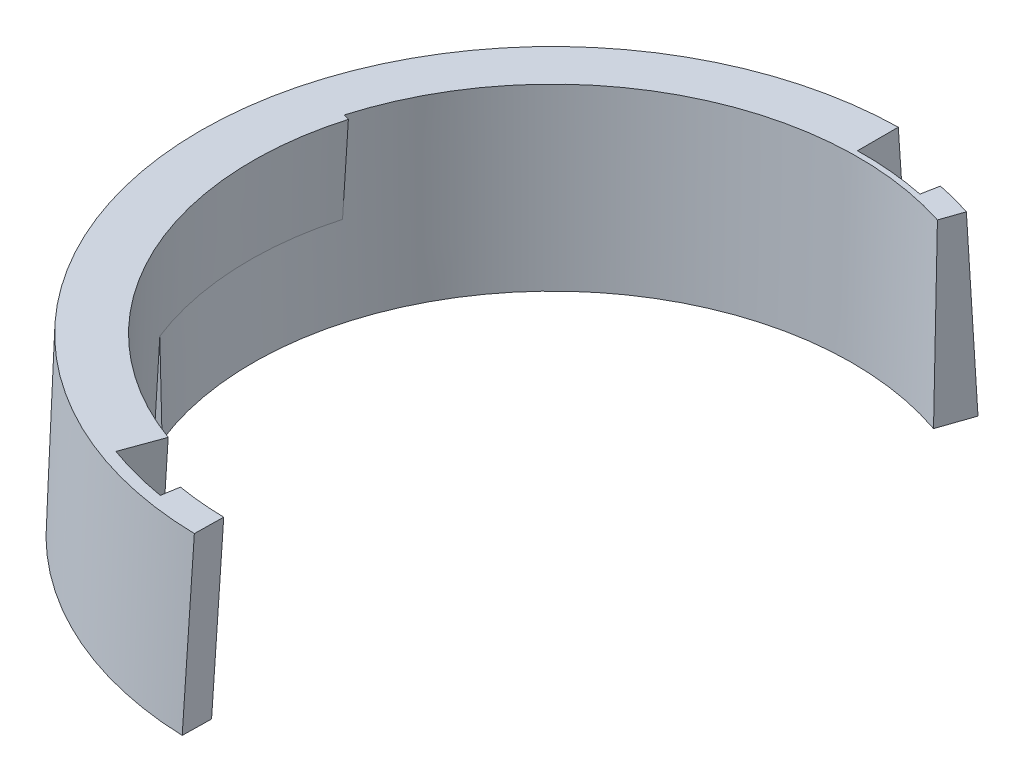
ISO-10303-21;
HEADER;
FILE_DESCRIPTION(('STEP AP214'),'2;1');
FILE_NAME('part.step','',(''),(''),'','','');
FILE_SCHEMA(('AUTOMOTIVE_DESIGN { 1 0 10303 214 1 1 1 1 }'));
ENDSEC;
DATA;
#1=APPLICATION_CONTEXT('core data for automotive mechanical design processes');
#2=APPLICATION_PROTOCOL_DEFINITION('international standard','automotive_design',2000,#1);
#3=PRODUCT_CONTEXT('',#1,'mechanical');
#4=PRODUCT('Part','Part','',(#3));
#5=PRODUCT_RELATED_PRODUCT_CATEGORY('part','',(#4));
#6=PRODUCT_DEFINITION_FORMATION('','',#4);
#7=PRODUCT_DEFINITION_CONTEXT('part definition',#1,'design');
#8=PRODUCT_DEFINITION('design','',#6,#7);
#9=PRODUCT_DEFINITION_SHAPE('','',#8);
#10=(LENGTH_UNIT() NAMED_UNIT(*) SI_UNIT(.MILLI.,.METRE.));
#11=(NAMED_UNIT(*) PLANE_ANGLE_UNIT() SI_UNIT($,.RADIAN.));
#12=(NAMED_UNIT(*) SI_UNIT($,.STERADIAN.) SOLID_ANGLE_UNIT());
#13=UNCERTAINTY_MEASURE_WITH_UNIT(LENGTH_MEASURE(1.E-05),#10,'distance_accuracy_value','');
#14=(GEOMETRIC_REPRESENTATION_CONTEXT(3) GLOBAL_UNCERTAINTY_ASSIGNED_CONTEXT((#13)) GLOBAL_UNIT_ASSIGNED_CONTEXT((#10,
#11,#12)) REPRESENTATION_CONTEXT('',''));
#15=CARTESIAN_POINT('',(0.,0.,0.));
#16=DIRECTION('',(0.,0.,1.));
#17=DIRECTION('',(1.,0.,0.));
#18=AXIS2_PLACEMENT_3D('',#15,#16,#17);
#19=CARTESIAN_POINT('',(0.,0.,0.));
#20=DIRECTION('',(0.,-1.,0.));
#21=DIRECTION('',(0.,0.,1.));
#22=AXIS2_PLACEMENT_3D('',#19,#20,#21);
#23=CONICAL_SURFACE('',#22,61.4034381309657,0.0349065850398866);
#24=CARTESIAN_POINT('',(0.,0.,0.));
#25=DIRECTION('',(0.,1.,0.));
#26=DIRECTION('',(0.,0.,1.));
#27=AXIS2_PLACEMENT_3D('',#24,#25,#26);
#28=CIRCLE('',#27,61.4034381309657);
#29=CARTESIAN_POINT('',(0.,0.,-61.4034381309657));
#30=VERTEX_POINT('',#29);
#31=CARTESIAN_POINT('',(-2.1189453036349,0.,61.3668663458021));
#32=VERTEX_POINT('',#31);
#33=EDGE_CURVE('E336',#30,#32,#28,.T.);
#34=ORIENTED_EDGE('',*,*,#33,.T.);
#35=CARTESIAN_POINT('',(-1.58727670122712,14.9682723992569,60.8578227023238));
#36=DIRECTION('',(-0.035476834527025,-0.998793085918968,0.0339671272321784));
#37=VECTOR('',#36,1.);
#38=LINE('',#35,#37);
#39=CARTESIAN_POINT('',(-1.58728567355379,14.9682915355134,60.8583759642603));
#40=VERTEX_POINT('',#39);
#41=EDGE_CURVE('E386',#40,#32,#38,.T.);
#42=ORIENTED_EDGE('',*,*,#41,.F.);
#43=CARTESIAN_POINT('',(-1.58731259083646,14.968348935764,60.8600357503626));
#44=CARTESIAN_POINT('',(-1.5872657472667,14.9696677422018,60.85999090271));
#45=CARTESIAN_POINT('',(-1.58721890369612,14.9709865486378,60.8599460550061));
#46=CARTESIAN_POINT('',(-1.58712521667649,14.9736241580376,60.8598563596136));
#47=CARTESIAN_POINT('',(-1.58707837322745,14.9749429610014,60.8598115119251));
#48=CARTESIAN_POINT('',(-1.58698468645092,14.9775805634567,60.8597218165633));
#49=CARTESIAN_POINT('',(-1.58693784312342,14.9788993629482,60.8596769688901));
#50=CARTESIAN_POINT('',(-1.58684415658999,14.9815369584589,60.8595872735591));
#51=CARTESIAN_POINT('',(-1.58679731338404,14.9828557544781,60.8595424259013));
#52=CARTESIAN_POINT('',(-1.5867036270937,14.9854933430442,60.859452730601));
#53=CARTESIAN_POINT('',(-1.5866567840093,14.9868121355912,60.8594078829586));
#54=CARTESIAN_POINT('',(-1.58656309796205,14.9894497172128,60.859318187689));
#55=CARTESIAN_POINT('',(-1.5865162549992,14.9907685062875,60.8592733400619));
#56=CARTESIAN_POINT('',(-1.58642256919505,14.9934060809645,60.8591836448231));
#57=CARTESIAN_POINT('',(-1.58637572635375,14.9947248665669,60.8591387972114));
#58=CARTESIAN_POINT('',(-1.58628204079269,14.9973624342994,60.8590491020033));
#59=CARTESIAN_POINT('',(-1.58623519807293,14.9986812164295,60.8590042544069));
#60=CARTESIAN_POINT('',(-1.58618835535235,14.9999999985579,60.8589594067593));
#61=B_SPLINE_CURVE_WITH_KNOTS('',3,(#43,#44,#45,#46,#47,#48,#49,#50,#51,#52,#53,#54,#55,#56,#57,
#58,#59,#60),.UNSPECIFIED.,.F.,.F.,(4,2,2,2,2,2,2,2,4),(0.,0.00396119987777217,
0.00792238933678482,0.0118835683770402,0.0158447369985381,0.0198058952012765,0.0237670429852575,
0.0277281803504851,0.031689307296948),.UNSPECIFIED.);
#62=CARTESIAN_POINT('',(-1.5861704101341,14.9999617294203,60.8578528571751));
#63=VERTEX_POINT('',#62);
#64=EDGE_CURVE('E372',#40,#63,#61,.T.);
#65=ORIENTED_EDGE('',*,*,#64,.T.);
#66=CARTESIAN_POINT('',(-1.05334711005954,30.0002,60.3466157020415));
#67=CARTESIAN_POINT('',(-1.22795560002416,25.0850928764568,60.5152212962289));
#68=CARTESIAN_POINT('',(-1.40255250684312,20.1699610921106,60.6831139482932));
#69=CARTESIAN_POINT('',(-1.75172315412765,10.3396482035604,61.0174733681161));
#70=CARTESIAN_POINT('',(-1.92629689459322,5.42446709935634,61.1839401358751));
#71=CARTESIAN_POINT('',(-2.10085905191316,0.509261334349333,61.3496939615115));
#72=B_SPLINE_CURVE_WITH_KNOTS('',3,(#66,#67,#68,#69,#70,#71),.UNSPECIFIED.,.F.,.F.,(4,2,4),(0.,
14.7632900235618,29.5265800418733),.UNSPECIFIED.);
#73=CARTESIAN_POINT('',(-1.05329381391964,30.001686219635,60.3465361663429));
#74=VERTEX_POINT('',#73);
#75=EDGE_CURVE('E202',#74,#63,#72,.T.);
#76=ORIENTED_EDGE('',*,*,#75,.F.);
#77=CARTESIAN_POINT('',(0.,30.,0.));
#78=DIRECTION('',(0.,1.,0.));
#79=DIRECTION('',(0.,0.,1.));
#80=AXIS2_PLACEMENT_3D('',#77,#78,#79);
#81=CIRCLE('',#80,60.3558150462133);
#82=CARTESIAN_POINT('',(-1.04762308475243,30.,-60.3467223282674));
#83=VERTEX_POINT('',#82);
#84=EDGE_CURVE('E604',#83,#74,#81,.T.);
#85=ORIENTED_EDGE('',*,*,#84,.F.);
#86=CARTESIAN_POINT('',(-1.04762308475243,30.,-60.3467223282674));
#87=CARTESIAN_POINT('',(-0.873021112862397,25.0000537092604,-60.5243683143377));
#88=CARTESIAN_POINT('',(-0.698418203170522,20.0000805633899,-60.7012509576153));
#89=CARTESIAN_POINT('',(-0.349210508253044,10.0000805633898,-61.0534895585141));
#90=CARTESIAN_POINT('',(-0.174605723027441,5.0000537092604,-61.228845516136));
#91=CARTESIAN_POINT('',(0.,0.,-61.4034381309657));
#92=B_SPLINE_CURVE_WITH_KNOTS('',3,(#86,#87,#88,#89,#90,#91),.UNSPECIFIED.,.F.,.F.,(4,2,4),(0.,
15.0184401968025,30.0368803875884),.UNSPECIFIED.);
#93=EDGE_CURVE('E258',#83,#30,#92,.T.);
#94=ORIENTED_EDGE('',*,*,#93,.T.);
#95=EDGE_LOOP('',(#34,#42,#65,#76,#85,#94));
#96=FACE_BOUND('',#95,.T.);
#97=ADVANCED_FACE('F53',(#96),#23,.T.);
#98=CARTESIAN_POINT('',(0.,30.,0.));
#99=DIRECTION('',(0.,-1.,0.));
#100=DIRECTION('',(0.,0.,1.));
#101=AXIS2_PLACEMENT_3D('',#98,#99,#100);
#102=CONICAL_SURFACE('',#101,51.4034381309657,0.0349065850398866);
#103=CARTESIAN_POINT('',(0.,0.,0.));
#104=DIRECTION('',(0.,1.,0.));
#105=DIRECTION('',(0.,0.,1.));
#106=AXIS2_PLACEMENT_3D('',#103,#104,#105);
#107=CIRCLE('',#106,52.4510612157182);
#108=CARTESIAN_POINT('',(-48.6215238860801,0.,19.6738719536942));
#109=VERTEX_POINT('',#108);
#110=CARTESIAN_POINT('',(-18.9201844933115,0.,48.9197346823761));
#111=VERTEX_POINT('',#110);
#112=EDGE_CURVE('E423',#109,#111,#107,.T.);
#113=ORIENTED_EDGE('',*,*,#112,.F.);
#114=CARTESIAN_POINT('',(-48.6215277406224,-0.0002,19.6738810476102));
#115=CARTESIAN_POINT('',(-48.5527802093637,3.56720435453582,19.5116751068177));
#116=CARTESIAN_POINT('',(-48.483612596789,7.13459279702392,19.3492997866978));
#117=CARTESIAN_POINT('',(-48.3444372089912,14.2693378587291,19.0242103877654));
#118=CARTESIAN_POINT('',(-48.274429433768,17.8366944779462,18.8614963089529));
#119=CARTESIAN_POINT('',(-48.2040015772285,21.4040351851156,18.6986128508128));
#120=B_SPLINE_CURVE_WITH_KNOTS('',3,(#114,#115,#116,#117,#118,#119),.UNSPECIFIED.,.F.,.F.,(4,2,
4),(0.,10.7152550984706,21.4305101994175),.UNSPECIFIED.);
#121=CARTESIAN_POINT('',(-48.3299840617232,15.0000000000001,18.9908372440811));
#122=VERTEX_POINT('',#121);
#123=EDGE_CURVE('E224',#109,#122,#120,.T.);
#124=ORIENTED_EDGE('',*,*,#123,.T.);
#125=CARTESIAN_POINT('',(0.,15.0000000000001,0.));
#126=DIRECTION('',(0.,-1.,0.));
#127=DIRECTION('',(0.,0.,-1.));
#128=AXIS2_PLACEMENT_3D('',#125,#126,#127);
#129=CIRCLE('',#128,51.927249673342);
#130=CARTESIAN_POINT('',(-50.0018798350972,15.0000000000001,-14.0089711111877));
#131=VERTEX_POINT('',#130);
#132=EDGE_CURVE('E231',#131,#122,#129,.F.);
#133=ORIENTED_EDGE('',*,*,#132,.F.);
#134=CARTESIAN_POINT('',(-50.6437036488404,0.,-13.6502418800343));
#135=CARTESIAN_POINT('',(-50.4305886348222,5.00005954067846,-13.770060962457));
#136=CARTESIAN_POINT('',(-50.2166460849028,10.0000893102687,-13.8896380833683));
#137=CARTESIAN_POINT('',(-49.7871059131332,20.0000893102688,-14.1283084022398));
#138=CARTESIAN_POINT('',(-49.571508291282,25.0000595406785,-14.2474016001997));
#139=CARTESIAN_POINT('',(-49.3550831335287,30.,-14.3662528366479));
#140=B_SPLINE_CURVE_WITH_KNOTS('',3,(#134,#135,#136,#137,#138,#139),.UNSPECIFIED.,.F.,.F.,(4,2,
4),(0.,15.0180994201564,30.0361988493114),.UNSPECIFIED.);
#141=CARTESIAN_POINT('',(-49.3550831335287,30.,-14.3662528366479));
#142=VERTEX_POINT('',#141);
#143=EDGE_CURVE('E185',#131,#142,#140,.T.);
#144=ORIENTED_EDGE('',*,*,#143,.T.);
#145=CARTESIAN_POINT('',(0.,30.,0.));
#146=DIRECTION('',(0.,1.,0.));
#147=DIRECTION('',(0.,0.,1.));
#148=AXIS2_PLACEMENT_3D('',#145,#146,#147);
#149=CIRCLE('',#148,51.4034381309657);
#150=CARTESIAN_POINT('',(-17.5810112769854,30.,48.3034314946934));
#151=VERTEX_POINT('',#150);
#152=EDGE_CURVE('E355',#142,#151,#149,.T.);
#153=ORIENTED_EDGE('',*,*,#152,.T.);
#154=CARTESIAN_POINT('',(-18.9201844933115,0.,48.9197346823761));
#155=CARTESIAN_POINT('',(-18.697576771539,5.00005954067846,48.8186385700876));
#156=CARTESIAN_POINT('',(-18.474675142659,10.0000893102687,48.7167319149854));
#157=CARTESIAN_POINT('',(-18.0282840705507,20.0000893102688,48.5112975190921));
#158=CARTESIAN_POINT('',(-17.8047946273219,25.0000595406785,48.4077697783001));
#159=CARTESIAN_POINT('',(-17.5810112769854,30.,48.3034314946933));
#160=B_SPLINE_CURVE_WITH_KNOTS('',3,(#154,#155,#156,#157,#158,#159),.UNSPECIFIED.,.F.,.F.,(4,2,
4),(0.,15.0180994201564,30.0361988493114),.UNSPECIFIED.);
#161=EDGE_CURVE('E218',#111,#151,#160,.T.);
#162=ORIENTED_EDGE('',*,*,#161,.F.);
#163=EDGE_LOOP('',(#113,#124,#133,#144,#153,#162));
#164=FACE_BOUND('',#163,.T.);
#165=ADVANCED_FACE('F208',(#164),#102,.F.);
#166=CARTESIAN_POINT('',(0.,0.,0.));
#167=DIRECTION('',(0.,1.,0.));
#168=DIRECTION('',(0.,0.,1.));
#169=AXIS2_PLACEMENT_3D('',#166,#167,#168);
#170=PLANE('',#169);
#171=DIRECTION('',(-0.325568154457157,0.,0.945518575599317));
#172=VECTOR('',#171,1.);
#173=CARTESIAN_POINT('',(0.,0.,0.));
#174=LINE('',#173,#172);
#175=CARTESIAN_POINT('',(18.6887314117941,0.,-54.2760170560942));
#176=VERTEX_POINT('',#175);
#177=CARTESIAN_POINT('',(16.7353224850512,0.,-48.6029056024983));
#178=VERTEX_POINT('',#177);
#179=EDGE_CURVE('E325',#176,#178,#174,.T.);
#180=ORIENTED_EDGE('',*,*,#179,.T.);
#181=CARTESIAN_POINT('',(0.,0.,0.));
#182=DIRECTION('',(0.,1.,0.));
#183=DIRECTION('',(0.,0.,1.));
#184=AXIS2_PLACEMENT_3D('',#181,#182,#183);
#185=CIRCLE('',#184,51.4034381309657);
#186=CARTESIAN_POINT('',(-47.6503894674759,0.,19.2809189428793));
#187=VERTEX_POINT('',#186);
#188=EDGE_CURVE('E328',#178,#187,#185,.T.);
#189=ORIENTED_EDGE('',*,*,#188,.T.);
#190=DIRECTION('',(0.926988372763554,0.,-0.375090064865999));
#191=VECTOR('',#190,1.);
#192=CARTESIAN_POINT('',(0.,0.,0.));
#193=LINE('',#192,#191);
#194=EDGE_CURVE('E332',#109,#187,#193,.T.);
#195=ORIENTED_EDGE('',*,*,#194,.F.);
#196=ORIENTED_EDGE('',*,*,#112,.T.);
#197=DIRECTION('',(0.342020143325675,0.,-0.939692620785906));
#198=VECTOR('',#197,1.);
#199=CARTESIAN_POINT('',(-0.984443682106884,0.,-0.358308197598333));
#200=LINE('',#199,#198);
#201=CARTESIAN_POINT('',(-21.3147469321907,0.,55.4987409126706));
#202=VERTEX_POINT('',#201);
#203=EDGE_CURVE('E369',#202,#111,#200,.T.);
#204=ORIENTED_EDGE('',*,*,#203,.F.);
#205=CARTESIAN_POINT('',(0.,0.,0.));
#206=DIRECTION('',(0.,1.,0.));
#207=DIRECTION('',(0.,0.,1.));
#208=AXIS2_PLACEMENT_3D('',#205,#206,#207);
#209=CIRCLE('',#208,59.4510612157182);
#210=CARTESIAN_POINT('',(-8.77747618152844,0.,58.7995288378893));
#211=VERTEX_POINT('',#210);
#212=EDGE_CURVE('E428',#202,#211,#209,.T.);
#213=ORIENTED_EDGE('',*,*,#212,.T.);
#214=DIRECTION('',(-0.165047605860686,0.,0.98628560153723));
#215=VECTOR('',#214,1.);
#216=CARTESIAN_POINT('',(1.0332555643294,0.,0.172907681982786));
#217=LINE('',#216,#215);
#218=CARTESIAN_POINT('',(-8.28225238250266,0.,55.840188107252));
#219=VERTEX_POINT('',#218);
#220=EDGE_CURVE('E172',#211,#219,#217,.F.);
#221=ORIENTED_EDGE('',*,*,#220,.T.);
#222=CARTESIAN_POINT('',(0.,0.,0.));
#223=DIRECTION('',(0.,1.,0.));
#224=DIRECTION('',(0.,0.,1.));
#225=AXIS2_PLACEMENT_3D('',#222,#223,#224);
#226=CIRCLE('',#225,56.4510612157182);
#227=CARTESIAN_POINT('',(-2.03250072252684,0.,56.4144596109339));
#228=VERTEX_POINT('',#227);
#229=EDGE_CURVE('E360',#228,#219,#226,.F.);
#230=ORIENTED_EDGE('',*,*,#229,.F.);
#231=DIRECTION('',(0.0174524064372834,0.,-0.999847695156391));
#232=VECTOR('',#231,1.);
#233=CARTESIAN_POINT('',(-1.04746352668235,0.,-0.01828354386818));
#234=LINE('',#233,#232);
#235=EDGE_CURVE('E356',#228,#32,#234,.F.);
#236=ORIENTED_EDGE('',*,*,#235,.T.);
#237=ORIENTED_EDGE('',*,*,#33,.F.);
#238=DIRECTION('',(0.,0.,1.));
#239=VECTOR('',#238,1.);
#240=CARTESIAN_POINT('',(0.,0.,0.));
#241=LINE('',#240,#239);
#242=CARTESIAN_POINT('',(0.,0.,-54.4034381309657));
#243=VERTEX_POINT('',#242);
#244=EDGE_CURVE('E333',#30,#243,#241,.T.);
#245=ORIENTED_EDGE('',*,*,#244,.T.);
#246=CARTESIAN_POINT('',(0.,0.,0.));
#247=DIRECTION('',(0.,1.,0.));
#248=DIRECTION('',(0.,0.,1.));
#249=AXIS2_PLACEMENT_3D('',#246,#247,#248);
#250=CIRCLE('',#249,54.4034381309657);
#251=CARTESIAN_POINT('',(9.91423913637608,0.,-53.492447530624));
#252=VERTEX_POINT('',#251);
#253=EDGE_CURVE('E335',#243,#252,#250,.F.);
#254=ORIENTED_EDGE('',*,*,#253,.T.);
#255=DIRECTION('',(-0.182235525492148,0.,0.983254907563955));
#256=VECTOR('',#255,1.);
#257=CARTESIAN_POINT('',(0.,0.,0.));
#258=LINE('',#257,#256);
#259=CARTESIAN_POINT('',(10.4609457128525,0.,-56.4422122533159));
#260=VERTEX_POINT('',#259);
#261=EDGE_CURVE('E319',#260,#252,#258,.T.);
#262=ORIENTED_EDGE('',*,*,#261,.F.);
#263=CARTESIAN_POINT('',(0.,0.,0.));
#264=DIRECTION('',(0.,1.,0.));
#265=DIRECTION('',(0.,0.,1.));
#266=AXIS2_PLACEMENT_3D('',#263,#264,#265);
#267=CIRCLE('',#266,57.4034381309657);
#268=EDGE_CURVE('E322',#176,#260,#267,.T.);
#269=ORIENTED_EDGE('',*,*,#268,.F.);
#270=EDGE_LOOP('',(#180,#189,#195,#196,#204,#213,#221,#230,#236,#237,#245,#254,#262,#269));
#271=FACE_BOUND('',#270,.T.);
#272=ADVANCED_FACE('F211',(#271),#170,.F.);
#273=CARTESIAN_POINT('',(0.,0.,0.));
#274=DIRECTION('',(0.374861570133077,0.034899496702501,0.926423676493254));
#275=DIRECTION('',(0.926988372763554,0.,-0.375090064865999));
#276=AXIS2_PLACEMENT_3D('',#273,#274,#275);
#277=PLANE('',#276);
#278=ORIENTED_EDGE('',*,*,#123,.F.);
#279=ORIENTED_EDGE('',*,*,#194,.T.);
#280=CARTESIAN_POINT('',(-49.0047775285767,30.,18.6988128508128));
#281=CARTESIAN_POINT('',(-48.780643872918,24.9999404593215,18.7964792529873));
#282=CARTESIAN_POINT('',(-48.5557113733644,19.9999106897313,18.8938212950656));
#283=CARTESIAN_POINT('',(-48.1042486863317,9.99991068973124,19.0878566590882));
#284=CARTESIAN_POINT('',(-47.8777184988518,4.9999404593215,19.184549981032));
#285=CARTESIAN_POINT('',(-47.6503894674759,0.,19.2809189428793));
#286=B_SPLINE_CURVE_WITH_KNOTS('',3,(#280,#281,#282,#283,#284,#285),.UNSPECIFIED.,.F.,.F.,(4,2,
4),(0.,15.0180994201564,30.0361988493114),.UNSPECIFIED.);
#287=EDGE_CURVE('E250',#122,#187,#286,.T.);
#288=ORIENTED_EDGE('',*,*,#287,.F.);
#289=EDGE_LOOP('',(#278,#279,#288));
#290=FACE_BOUND('',#289,.T.);
#291=ADVANCED_FACE('F239',(#290),#277,.T.);
#292=CARTESIAN_POINT('',(0.,0.,0.));
#293=DIRECTION('',(0.999390827019096,0.034899496702501,0.));
#294=DIRECTION('',(-0.034899496702501,0.999390827019096,0.));
#295=AXIS2_PLACEMENT_3D('',#292,#293,#294);
#296=PLANE('',#295);
#297=ORIENTED_EDGE('',*,*,#244,.F.);
#298=ORIENTED_EDGE('',*,*,#93,.F.);
#299=DIRECTION('',(0.,0.,1.));
#300=VECTOR('',#299,1.);
#301=CARTESIAN_POINT('',(-1.04762308475243,30.,0.));
#302=LINE('',#301,#300);
#303=CARTESIAN_POINT('',(-1.04762308475243,30.,-53.3455291952195));
#304=VERTEX_POINT('',#303);
#305=EDGE_CURVE('E610',#83,#304,#302,.T.);
#306=ORIENTED_EDGE('',*,*,#305,.T.);
#307=CARTESIAN_POINT('',(-1.04762308475243,30.,-53.3455291952195));
#308=CARTESIAN_POINT('',(-0.873021363737469,25.0000608933826,-53.5235763022949));
#309=CARTESIAN_POINT('',(-0.698418579475277,20.0000913393482,-53.7007589338368));
#310=CARTESIAN_POINT('',(-0.349210884557798,10.0000913393481,-54.0533952457512));
#311=CARTESIAN_POINT('',(-0.174605973902513,5.00006089338253,-54.2288489261247));
#312=CARTESIAN_POINT('',(0.,0.,-54.4034381309657));
#313=B_SPLINE_CURVE_WITH_KNOTS('',3,(#307,#308,#309,#310,#311,#312),.UNSPECIFIED.,.F.,.F.,(4,2,
4),(0.,15.018461246951,30.0369224851831),.UNSPECIFIED.);
#314=EDGE_CURVE('E314',#304,#243,#313,.T.);
#315=ORIENTED_EDGE('',*,*,#314,.T.);
#316=EDGE_LOOP('',(#297,#298,#306,#315));
#317=FACE_BOUND('',#316,.T.);
#318=ADVANCED_FACE('F243',(#317),#296,.T.);
#319=CARTESIAN_POINT('',(0.,0.,0.));
#320=DIRECTION('',(0.,-1.,0.));
#321=DIRECTION('',(0.,0.,1.));
#322=AXIS2_PLACEMENT_3D('',#319,#320,#321);
#323=CONICAL_SURFACE('',#322,54.4034381309657,0.0349065850398866);
#324=ORIENTED_EDGE('',*,*,#253,.F.);
#325=ORIENTED_EDGE('',*,*,#314,.F.);
#326=CARTESIAN_POINT('',(0.,30.,0.));
#327=DIRECTION('',(0.,1.,0.));
#328=DIRECTION('',(0.,0.,1.));
#329=AXIS2_PLACEMENT_3D('',#326,#327,#328);
#330=CIRCLE('',#329,53.3558150462133);
#331=CARTESIAN_POINT('',(10.7515310849076,30.,-52.2613392344282));
#332=VERTEX_POINT('',#331);
#333=EDGE_CURVE('E323',#304,#332,#330,.F.);
#334=ORIENTED_EDGE('',*,*,#333,.T.);
#335=CARTESIAN_POINT('',(10.7515310849076,30.,-52.2613392344282));
#336=CARTESIAN_POINT('',(10.6122995939708,25.0000608933826,-52.4682235626186));
#337=CARTESIAN_POINT('',(10.4729095194378,20.0000913393482,-52.6742580847597));
#338=CARTESIAN_POINT('',(10.1938122032604,10.0000913393481,-53.084627516824));
#339=CARTESIAN_POINT('',(10.0541049616162,5.00006089338253,-53.2889624267482));
#340=CARTESIAN_POINT('',(9.91423913637607,0.,-53.492447530624));
#341=B_SPLINE_CURVE_WITH_KNOTS('',3,(#335,#336,#337,#338,#339,#340),.UNSPECIFIED.,.F.,.F.,(4,2,
4),(0.,15.018461246951,30.0369224851831),.UNSPECIFIED.);
#342=EDGE_CURVE('E296',#332,#252,#341,.T.);
#343=ORIENTED_EDGE('',*,*,#342,.T.);
#344=EDGE_LOOP('',(#324,#325,#334,#343));
#345=FACE_BOUND('',#344,.T.);
#346=ADVANCED_FACE('F305',(#345),#323,.T.);
#347=CARTESIAN_POINT('',(0.,0.,0.));
#348=DIRECTION('',(-0.982655935240925,0.034899496702501,-0.182124512533857));
#349=DIRECTION('',(-0.182235525492148,0.,0.983254907563955));
#350=AXIS2_PLACEMENT_3D('',#347,#348,#349);
#351=PLANE('',#350);
#352=ORIENTED_EDGE('',*,*,#261,.T.);
#353=ORIENTED_EDGE('',*,*,#342,.F.);
#354=DIRECTION('',(0.182235525492148,0.,-0.983254907563955));
#355=VECTOR('',#354,1.);
#356=CARTESIAN_POINT('',(1.0300805393601,30.,0.19091414336756));
#357=LINE('',#356,#355);
#358=CARTESIAN_POINT('',(11.2983374619385,30.,-55.2116424327257));
#359=VERTEX_POINT('',#358);
#360=EDGE_CURVE('E597',#359,#332,#357,.F.);
#361=ORIENTED_EDGE('',*,*,#360,.F.);
#362=CARTESIAN_POINT('',(11.2983374619385,30.,-55.2116424327257));
#363=CARTESIAN_POINT('',(11.1590722954227,25.0000575919434,-55.4183456963874));
#364=CARTESIAN_POINT('',(11.0196570663904,20.0000863872996,-55.6242448132925));
#365=CARTESIAN_POINT('',(10.7405264833615,10.0000863872995,-56.0344347534884));
#366=CARTESIAN_POINT('',(10.6008111293652,5.00005759194337,-56.2387255767801));
#367=CARTESIAN_POINT('',(10.4609457128525,0.,-56.4422122533159));
#368=B_SPLINE_CURVE_WITH_KNOTS('',3,(#362,#363,#364,#365,#366,#367),.UNSPECIFIED.,.F.,.F.,(4,2,
4),(0.,15.0184515812138,30.0369031550322),.UNSPECIFIED.);
#369=EDGE_CURVE('E290',#359,#260,#368,.T.);
#370=ORIENTED_EDGE('',*,*,#369,.T.);
#371=EDGE_LOOP('',(#352,#353,#361,#370));
#372=FACE_BOUND('',#371,.T.);
#373=ADVANCED_FACE('F302',(#372),#351,.T.);
#374=CARTESIAN_POINT('',(0.,0.,0.));
#375=DIRECTION('',(0.,-1.,0.));
#376=DIRECTION('',(0.,0.,1.));
#377=AXIS2_PLACEMENT_3D('',#374,#375,#376);
#378=CONICAL_SURFACE('',#377,57.4034381309657,0.0349065850398866);
#379=ORIENTED_EDGE('',*,*,#268,.T.);
#380=ORIENTED_EDGE('',*,*,#369,.F.);
#381=CARTESIAN_POINT('',(0.,30.,0.));
#382=DIRECTION('',(0.,1.,0.));
#383=DIRECTION('',(0.,0.,1.));
#384=AXIS2_PLACEMENT_3D('',#381,#382,#383);
#385=CIRCLE('',#384,56.3558150462133);
#386=CARTESIAN_POINT('',(17.3539411612331,30.,-53.617335029778));
#387=VERTEX_POINT('',#386);
#388=EDGE_CURVE('E600',#387,#359,#385,.T.);
#389=ORIENTED_EDGE('',*,*,#388,.F.);
#390=CARTESIAN_POINT('',(17.3539411612331,30.,-53.617335029778));
#391=CARTESIAN_POINT('',(17.5769369491335,25.0000575919434,-53.7286629435812));
#392=CARTESIAN_POINT('',(17.7996673639911,20.0000863872996,-53.8392170693558));
#393=CARTESIAN_POINT('',(18.2445974475112,10.0000863872995,-54.0587777447938));
#394=CARTESIAN_POINT('',(18.4667971161739,5.00005759194337,-54.1677842944579));
#395=CARTESIAN_POINT('',(18.6887314117941,0.,-54.2760170560942));
#396=B_SPLINE_CURVE_WITH_KNOTS('',3,(#390,#391,#392,#393,#394,#395),.UNSPECIFIED.,.F.,.F.,(4,2,
4),(0.,15.0184515812138,30.0369031550322),.UNSPECIFIED.);
#397=EDGE_CURVE('E285',#387,#176,#396,.T.);
#398=ORIENTED_EDGE('',*,*,#397,.T.);
#399=EDGE_LOOP('',(#379,#380,#389,#398));
#400=FACE_BOUND('',#399,.T.);
#401=ADVANCED_FACE('F280',(#400),#378,.T.);
#402=CARTESIAN_POINT('',(0.,0.,0.));
#403=DIRECTION('',(0.944942591230119,0.034899496702501,0.325369827134019));
#404=DIRECTION('',(0.325568154457157,0.,-0.945518575599317));
#405=AXIS2_PLACEMENT_3D('',#402,#403,#404);
#406=PLANE('',#405);
#407=ORIENTED_EDGE('',*,*,#179,.F.);
#408=ORIENTED_EDGE('',*,*,#397,.F.);
#409=DIRECTION('',(-0.325568154457157,0.,0.945518575599317));
#410=VECTOR('',#409,1.);
#411=CARTESIAN_POINT('',(-0.990547086860047,30.,-0.341072714269551));
#412=LINE('',#411,#410);
#413=CARTESIAN_POINT('',(16.0824415913698,30.,-49.9246321480208));
#414=VERTEX_POINT('',#413);
#415=EDGE_CURVE('E602',#387,#414,#412,.T.);
#416=ORIENTED_EDGE('',*,*,#415,.T.);
#417=CARTESIAN_POINT('',(16.0824415913698,30.,-49.9246321480208));
#418=CARTESIAN_POINT('',(16.1918184384154,24.9999404593215,-49.7059741341202));
#419=CARTESIAN_POINT('',(16.3009136030622,19.9999106897313,-49.4865012484096));
#420=CARTESIAN_POINT('',(16.518540567623,9.99991068973124,-49.0459257332364));
#421=CARTESIAN_POINT('',(16.6270723675367,4.9999404593215,-48.8248231037728));
#422=CARTESIAN_POINT('',(16.7353224850512,0.,-48.6029056024983));
#423=B_SPLINE_CURVE_WITH_KNOTS('',3,(#417,#418,#419,#420,#421,#422),.UNSPECIFIED.,.F.,.F.,(4,2,
4),(0.,15.0180994201564,30.0361988493114),.UNSPECIFIED.);
#424=EDGE_CURVE('E257',#414,#178,#423,.T.);
#425=ORIENTED_EDGE('',*,*,#424,.T.);
#426=EDGE_LOOP('',(#407,#408,#416,#425));
#427=FACE_BOUND('',#426,.T.);
#428=ADVANCED_FACE('F274',(#427),#406,.T.);
#429=CARTESIAN_POINT('',(0.,30.,0.));
#430=DIRECTION('',(-0.985684782997319,-0.034899496702501,-0.164947063318633));
#431=DIRECTION('',(-0.165047605860686,0.,0.98628560153723));
#432=AXIS2_PLACEMENT_3D('',#429,#430,#431);
#433=PLANE('',#432);
#434=DIRECTION('',(0.165047605860686,0.,-0.98628560153723));
#435=VECTOR('',#434,1.);
#436=CARTESIAN_POINT('',(0.,30.,0.));
#437=LINE('',#436,#435);
#438=CARTESIAN_POINT('',(-9.63934763754852,30.,57.6024701088419));
#439=VERTEX_POINT('',#438);
#440=CARTESIAN_POINT('',(-9.14420481996646,30.,54.6436133042302));
#441=VERTEX_POINT('',#440);
#442=EDGE_CURVE('E163',#439,#441,#437,.T.);
#443=ORIENTED_EDGE('',*,*,#442,.T.);
#444=CARTESIAN_POINT('',(-8.28225238250266,0.,55.840188107252));
#445=CARTESIAN_POINT('',(-8.42617765232588,5.00005540041998,55.6423399737408));
#446=CARTESIAN_POINT('',(-8.5699696570089,10.0000831000288,55.4437013400909));
#447=CARTESIAN_POINT('',(-8.85728713616363,20.0000831000288,55.0448430724177));
#448=CARTESIAN_POINT('',(-9.00081261063521,25.00005540042,54.8446234383937));
#449=CARTESIAN_POINT('',(-9.14420481996647,30.,54.6436133042303));
#450=B_SPLINE_CURVE_WITH_KNOTS('',3,(#444,#445,#446,#447,#448,#449),.UNSPECIFIED.,.F.,.F.,(4,2,
4),(0.,15.0181121982158,30.0362244036547),.UNSPECIFIED.);
#451=EDGE_CURVE('E174',#219,#441,#450,.T.);
#452=ORIENTED_EDGE('',*,*,#451,.F.);
#453=ORIENTED_EDGE('',*,*,#220,.F.);
#454=CARTESIAN_POINT('',(-8.77747618152844,0.,58.7995288378893));
#455=CARTESIAN_POINT('',(-8.92137462348706,5.00005265428903,58.6015209684072));
#456=CARTESIAN_POINT('',(-9.06514646578661,10.0000789809186,58.4027621395995));
#457=CARTESIAN_POINT('',(-9.35243695112675,20.0000789809186,58.0037425632511));
#458=CARTESIAN_POINT('',(-9.49595559416722,25.0000526542891,57.8034818157096));
#459=CARTESIAN_POINT('',(-9.63934763754852,30.,57.6024701088419));
#460=B_SPLINE_CURVE_WITH_KNOTS('',3,(#454,#455,#456,#457,#458,#459),.UNSPECIFIED.,.F.,.F.,(4,2,
4),(0.,15.0181206592205,30.0362413246276),.UNSPECIFIED.);
#461=EDGE_CURVE('E156',#211,#439,#460,.T.);
#462=ORIENTED_EDGE('',*,*,#461,.T.);
#463=EDGE_LOOP('',(#443,#452,#453,#462));
#464=FACE_BOUND('',#463,.T.);
#465=ADVANCED_FACE('F168',(#464),#433,.T.);
#466=CARTESIAN_POINT('',(0.,30.,0.));
#467=DIRECTION('',(0.,-1.,0.));
#468=DIRECTION('',(0.,0.,1.));
#469=AXIS2_PLACEMENT_3D('',#466,#467,#468);
#470=CONICAL_SURFACE('',#469,55.4034381309657,0.0349065850398866);
#471=CARTESIAN_POINT('',(0.,30.,0.));
#472=DIRECTION('',(0.,1.,0.));
#473=DIRECTION('',(0.,0.,1.));
#474=AXIS2_PLACEMENT_3D('',#471,#472,#473);
#475=CIRCLE('',#474,55.4034381309657);
#476=CARTESIAN_POINT('',(-0.966923320284498,30.,55.3949999189858));
#477=VERTEX_POINT('',#476);
#478=EDGE_CURVE('E64',#477,#441,#475,.F.);
#479=ORIENTED_EDGE('',*,*,#478,.F.);
#480=CARTESIAN_POINT('',(-2.03250072252684,0.,56.4144596109339));
#481=CARTESIAN_POINT('',(-1.85493053607263,5.00005540041998,56.2461527598844));
#482=CARTESIAN_POINT('',(-1.67734732601336,10.0000831000288,56.0770443600513));
#483=CARTESIAN_POINT('',(-1.32215485859926,20.0000831000288,55.7372244627361));
#484=CARTESIAN_POINT('',(-1.14454560124442,25.00005540042,55.5665129652532));
#485=CARTESIAN_POINT('',(-0.966923320284498,30.,55.3949999189858));
#486=B_SPLINE_CURVE_WITH_KNOTS('',3,(#480,#481,#482,#483,#484,#485),.UNSPECIFIED.,.F.,.F.,(4,2,
4),(0.,15.0181121982158,30.0362244036547),.UNSPECIFIED.);
#487=EDGE_CURVE('E425',#228,#477,#486,.T.);
#488=ORIENTED_EDGE('',*,*,#487,.F.);
#489=ORIENTED_EDGE('',*,*,#229,.T.);
#490=ORIENTED_EDGE('',*,*,#451,.T.);
#491=EDGE_LOOP('',(#479,#488,#489,#490));
#492=FACE_BOUND('',#491,.T.);
#493=ADVANCED_FACE('F245',(#492),#470,.F.);
#494=CARTESIAN_POINT('',(0.,30.,0.));
#495=DIRECTION('',(0.,-1.,0.));
#496=DIRECTION('',(0.,0.,1.));
#497=AXIS2_PLACEMENT_3D('',#494,#495,#496);
#498=CONICAL_SURFACE('',#497,58.4034381309657,0.0349065850398866);
#499=CARTESIAN_POINT('',(0.,30.,0.));
#500=DIRECTION('',(0.,1.,0.));
#501=DIRECTION('',(0.,0.,1.));
#502=AXIS2_PLACEMENT_3D('',#499,#500,#501);
#503=CIRCLE('',#502,58.4034381309657);
#504=CARTESIAN_POINT('',(-19.9751522802651,30.,54.8812798401947));
#505=VERTEX_POINT('',#504);
#506=EDGE_CURVE('E153',#505,#439,#503,.T.);
#507=ORIENTED_EDGE('',*,*,#506,.T.);
#508=ORIENTED_EDGE('',*,*,#461,.F.);
#509=ORIENTED_EDGE('',*,*,#212,.F.);
#510=CARTESIAN_POINT('',(-21.3147469321907,0.,55.4987409126706));
#511=CARTESIAN_POINT('',(-21.0920003635762,5.00005265428903,55.3972626187086));
#512=CARTESIAN_POINT('',(-20.8689941916316,10.0000789809186,55.2950683823653));
#513=CARTESIAN_POINT('',(-20.42246264099,20.0000789809186,55.0892480248739));
#514=CARTESIAN_POINT('',(-20.1989372622928,25.0000526542891,54.9856219037252));
#515=CARTESIAN_POINT('',(-19.9751522802651,30.,54.8812798401947));
#516=B_SPLINE_CURVE_WITH_KNOTS('',3,(#510,#511,#512,#513,#514,#515),.UNSPECIFIED.,.F.,.F.,(4,2,
4),(0.,15.0181206592205,30.0362413246276),.UNSPECIFIED.);
#517=EDGE_CURVE('E158',#202,#505,#516,.T.);
#518=ORIENTED_EDGE('',*,*,#517,.T.);
#519=EDGE_LOOP('',(#507,#508,#509,#518));
#520=FACE_BOUND('',#519,.T.);
#521=ADVANCED_FACE('F155',(#520),#498,.F.);
#522=CARTESIAN_POINT('',(0.,30.,0.));
#523=DIRECTION('',(0.,1.,0.));
#524=DIRECTION('',(0.,0.,1.));
#525=AXIS2_PLACEMENT_3D('',#522,#523,#524);
#526=PLANE('',#525);
#527=ORIENTED_EDGE('',*,*,#305,.F.);
#528=ORIENTED_EDGE('',*,*,#84,.T.);
#529=DIRECTION('',(-0.0174524064372834,0.,0.999847695156391));
#530=VECTOR('',#529,1.);
#531=CARTESIAN_POINT('',(0.,30.,0.));
#532=LINE('',#531,#530);
#533=EDGE_CURVE('E12',#477,#74,#532,.T.);
#534=ORIENTED_EDGE('',*,*,#533,.F.);
#535=ORIENTED_EDGE('',*,*,#478,.T.);
#536=ORIENTED_EDGE('',*,*,#442,.F.);
#537=ORIENTED_EDGE('',*,*,#506,.F.);
#538=DIRECTION('',(0.342020143325675,0.,-0.939692620785906));
#539=VECTOR('',#538,1.);
#540=CARTESIAN_POINT('',(0.,30.,0.));
#541=LINE('',#540,#539);
#542=EDGE_CURVE('E164',#505,#151,#541,.T.);
#543=ORIENTED_EDGE('',*,*,#542,.T.);
#544=ORIENTED_EDGE('',*,*,#152,.F.);
#545=DIRECTION('',(0.96015140091956,0.,0.279480388063646));
#546=VECTOR('',#545,1.);
#547=CARTESIAN_POINT('',(0.,30.,0.));
#548=LINE('',#547,#546);
#549=CARTESIAN_POINT('',(-50.3609599059894,30.,-14.659042942919));
#550=VERTEX_POINT('',#549);
#551=EDGE_CURVE('E351',#550,#142,#548,.T.);
#552=ORIENTED_EDGE('',*,*,#551,.F.);
#553=CARTESIAN_POINT('',(0.,30.,0.));
#554=DIRECTION('',(0.,1.,0.));
#555=DIRECTION('',(0.,0.,1.));
#556=AXIS2_PLACEMENT_3D('',#553,#554,#555);
#557=CIRCLE('',#556,52.4510612157182);
#558=EDGE_CURVE('E347',#414,#550,#557,.T.);
#559=ORIENTED_EDGE('',*,*,#558,.F.);
#560=ORIENTED_EDGE('',*,*,#415,.F.);
#561=ORIENTED_EDGE('',*,*,#388,.T.);
#562=ORIENTED_EDGE('',*,*,#360,.T.);
#563=ORIENTED_EDGE('',*,*,#333,.F.);
#564=EDGE_LOOP('',(#527,#528,#534,#535,#536,#537,#543,#544,#552,#559,#560,#561,#562,#563));
#565=FACE_BOUND('',#564,.T.);
#566=ADVANCED_FACE('F177',(#565),#526,.T.);
#567=CARTESIAN_POINT('',(0.,30.,0.));
#568=DIRECTION('',(0.939120185430968,-0.034899496702501,0.341811793895436));
#569=DIRECTION('',(0.342020143325675,0.,-0.939692620785906));
#570=AXIS2_PLACEMENT_3D('',#567,#568,#569);
#571=PLANE('',#570);
#572=ORIENTED_EDGE('',*,*,#542,.F.);
#573=ORIENTED_EDGE('',*,*,#517,.F.);
#574=ORIENTED_EDGE('',*,*,#203,.T.);
#575=ORIENTED_EDGE('',*,*,#161,.T.);
#576=EDGE_LOOP('',(#572,#573,#574,#575));
#577=FACE_BOUND('',#576,.T.);
#578=ADVANCED_FACE('F272',(#577),#571,.T.);
#579=CARTESIAN_POINT('',(0.,0.,0.));
#580=DIRECTION('',(0.,1.,0.));
#581=DIRECTION('',(0.,0.,1.));
#582=AXIS2_PLACEMENT_3D('',#579,#580,#581);
#583=CONICAL_SURFACE('',#582,51.4034381309657,0.0349065850398866);
#584=CARTESIAN_POINT('',(-50.3609646599001,30.0002,-14.659051600698));
#585=CARTESIAN_POINT('',(-50.2687955663398,26.1222505915084,-14.4911817925866));
#586=CARTESIAN_POINT('',(-50.1761114075856,22.2443200336257,-14.3231627451548));
#587=CARTESIAN_POINT('',(-49.9897129596613,14.488496617922,-13.9868261716003));
#588=CARTESIAN_POINT('',(-49.895998670491,10.6106037601009,-13.8185086454775));
#589=CARTESIAN_POINT('',(-49.8017693161263,6.73272975288886,-13.6500418800343));
#590=B_SPLINE_CURVE_WITH_KNOTS('',3,(#584,#585,#586,#587,#588,#589),.UNSPECIFIED.,.F.,.F.,(4,2,
4),(0.,11.6480253900864,23.2960507836459),.UNSPECIFIED.);
#591=EDGE_CURVE('E232',#550,#131,#590,.T.);
#592=ORIENTED_EDGE('',*,*,#591,.T.);
#593=ORIENTED_EDGE('',*,*,#132,.T.);
#594=ORIENTED_EDGE('',*,*,#287,.T.);
#595=ORIENTED_EDGE('',*,*,#188,.F.);
#596=ORIENTED_EDGE('',*,*,#424,.F.);
#597=ORIENTED_EDGE('',*,*,#558,.T.);
#598=EDGE_LOOP('',(#592,#593,#594,#595,#596,#597));
#599=FACE_BOUND('',#598,.T.);
#600=ADVANCED_FACE('F269',(#599),#583,.F.);
#601=CARTESIAN_POINT('',(0.,30.,0.));
#602=DIRECTION('',(0.279310136162545,-0.034899496702501,-0.959566502628543));
#603=DIRECTION('',(-0.96015140091956,0.,-0.279480388063646));
#604=AXIS2_PLACEMENT_3D('',#601,#602,#603);
#605=PLANE('',#604);
#606=ORIENTED_EDGE('',*,*,#591,.F.);
#607=ORIENTED_EDGE('',*,*,#551,.T.);
#608=ORIENTED_EDGE('',*,*,#143,.F.);
#609=EDGE_LOOP('',(#606,#607,#608));
#610=FACE_BOUND('',#609,.T.);
#611=ADVANCED_FACE('F213',(#610),#605,.T.);
#612=CARTESIAN_POINT('',(0.,30.,0.));
#613=DIRECTION('',(0.999238614955483,-0.034899496702501,0.0174417749028301));
#614=DIRECTION('',(0.0349048063981253,0.999390641586317,0.));
#615=AXIS2_PLACEMENT_3D('',#612,#613,#614);
#616=PLANE('',#615);
#617=ORIENTED_EDGE('',*,*,#533,.T.);
#618=ORIENTED_EDGE('',*,*,#75,.T.);
#619=ORIENTED_EDGE('',*,*,#64,.F.);
#620=ORIENTED_EDGE('',*,*,#41,.T.);
#621=ORIENTED_EDGE('',*,*,#235,.F.);
#622=ORIENTED_EDGE('',*,*,#487,.T.);
#623=EDGE_LOOP('',(#617,#618,#619,#620,#621,#622));
#624=FACE_BOUND('',#623,.T.);
#625=ADVANCED_FACE('F55',(#624),#616,.T.);
#626=CLOSED_SHELL('',(#97,#165,#272,#291,#318,#346,#373,#401,#428,#465,#493,#521,#566,#578,#600,
#611,#625));
#627=MANIFOLD_SOLID_BREP('B2',#626);
#628=ADVANCED_BREP_SHAPE_REPRESENTATION('',(#18,#627),#14);
#629=SHAPE_DEFINITION_REPRESENTATION(#9,#628);
ENDSEC;
END-ISO-10303-21;
